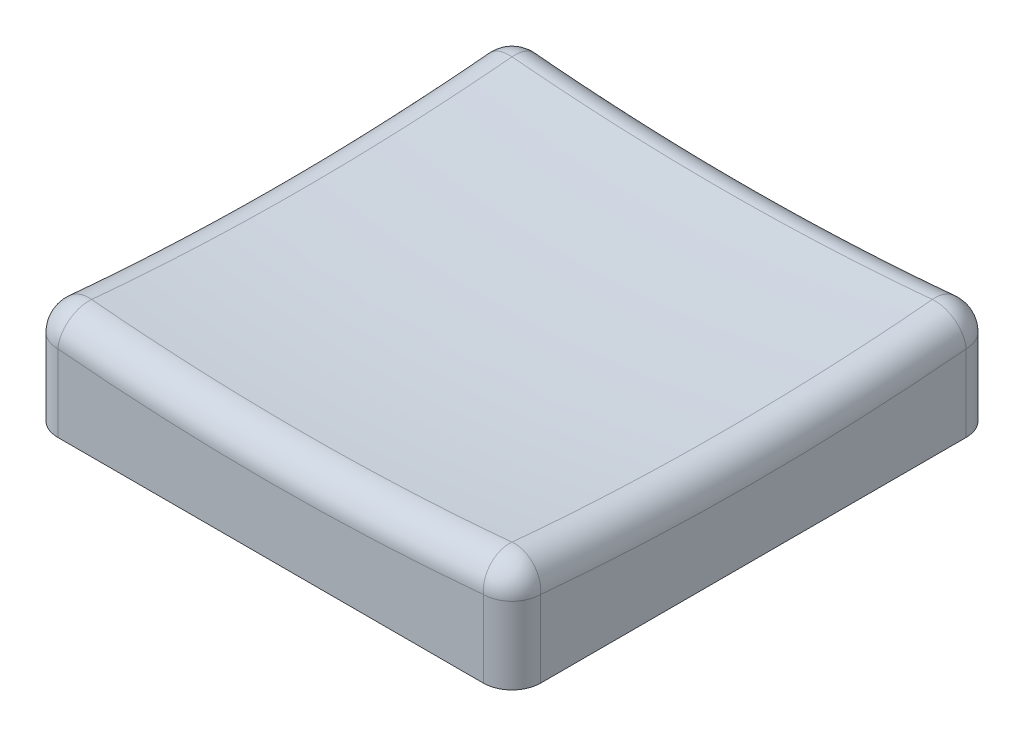
ISO-10303-21;
HEADER;
FILE_DESCRIPTION(('STEP AP214'),'2;1');
FILE_NAME('part.step','',(''),(''),'','','');
FILE_SCHEMA(('AUTOMOTIVE_DESIGN { 1 0 10303 214 1 1 1 1 }'));
ENDSEC;
DATA;
#1=APPLICATION_CONTEXT('core data for automotive mechanical design processes');
#2=APPLICATION_PROTOCOL_DEFINITION('international standard','automotive_design',2000,#1);
#3=PRODUCT_CONTEXT('',#1,'mechanical');
#4=PRODUCT('Part','Part','',(#3));
#5=PRODUCT_RELATED_PRODUCT_CATEGORY('part','',(#4));
#6=PRODUCT_DEFINITION_FORMATION('','',#4);
#7=PRODUCT_DEFINITION_CONTEXT('part definition',#1,'design');
#8=PRODUCT_DEFINITION('design','',#6,#7);
#9=PRODUCT_DEFINITION_SHAPE('','',#8);
#10=(LENGTH_UNIT() NAMED_UNIT(*) SI_UNIT(.MILLI.,.METRE.));
#11=(NAMED_UNIT(*) PLANE_ANGLE_UNIT() SI_UNIT($,.RADIAN.));
#12=(NAMED_UNIT(*) SI_UNIT($,.STERADIAN.) SOLID_ANGLE_UNIT());
#13=UNCERTAINTY_MEASURE_WITH_UNIT(LENGTH_MEASURE(1.E-05),#10,'distance_accuracy_value','');
#14=(GEOMETRIC_REPRESENTATION_CONTEXT(3) GLOBAL_UNCERTAINTY_ASSIGNED_CONTEXT((#13)) GLOBAL_UNIT_ASSIGNED_CONTEXT((#10,
#11,#12)) REPRESENTATION_CONTEXT('',''));
#15=CARTESIAN_POINT('',(0.,0.,0.));
#16=DIRECTION('',(0.,0.,1.));
#17=DIRECTION('',(1.,0.,0.));
#18=AXIS2_PLACEMENT_3D('',#15,#16,#17);
#19=CARTESIAN_POINT('',(8.425,4.,-8.425));
#20=DIRECTION('',(-1.,0.,0.));
#21=DIRECTION('',(0.,0.,1.));
#22=AXIS2_PLACEMENT_3D('',#19,#20,#21);
#23=PLANE('',#22);
#24=CARTESIAN_POINT('',(8.425,83.5,0.));
#25=DIRECTION('',(-1.,0.,0.));
#26=DIRECTION('',(0.,0.,1.));
#27=AXIS2_PLACEMENT_3D('',#24,#25,#26);
#28=CIRCLE('',#27,81.1610705634173);
#29=CARTESIAN_POINT('',(8.425,2.67928019375229,-7.425));
#30=VERTEX_POINT('',#29);
#31=CARTESIAN_POINT('',(8.425,2.67928019375229,7.425));
#32=VERTEX_POINT('',#31);
#33=EDGE_CURVE('E212',#30,#32,#28,.T.);
#34=ORIENTED_EDGE('',*,*,#33,.T.);
#35=DIRECTION('',(0.,-1.,0.));
#36=VECTOR('',#35,1.);
#37=CARTESIAN_POINT('',(8.425,4.,7.425));
#38=LINE('',#37,#36);
#39=CARTESIAN_POINT('',(8.425,0.,7.425));
#40=VERTEX_POINT('',#39);
#41=EDGE_CURVE('E215',#32,#40,#38,.T.);
#42=ORIENTED_EDGE('',*,*,#41,.T.);
#43=DIRECTION('',(0.,0.,-1.));
#44=VECTOR('',#43,1.);
#45=CARTESIAN_POINT('',(8.425,0.,-8.425));
#46=LINE('',#45,#44);
#47=CARTESIAN_POINT('',(8.425,0.,-7.425));
#48=VERTEX_POINT('',#47);
#49=EDGE_CURVE('E167',#40,#48,#46,.T.);
#50=ORIENTED_EDGE('',*,*,#49,.T.);
#51=DIRECTION('',(0.,-1.,0.));
#52=VECTOR('',#51,1.);
#53=CARTESIAN_POINT('',(8.425,4.,-7.425));
#54=LINE('',#53,#52);
#55=EDGE_CURVE('E209',#48,#30,#54,.F.);
#56=ORIENTED_EDGE('',*,*,#55,.T.);
#57=EDGE_LOOP('',(#34,#42,#50,#56));
#58=FACE_BOUND('',#57,.T.);
#59=ADVANCED_FACE('F39',(#58),#23,.F.);
#60=CARTESIAN_POINT('',(-8.425,4.,-8.425));
#61=DIRECTION('',(0.,0.,1.));
#62=DIRECTION('',(1.,0.,0.));
#63=AXIS2_PLACEMENT_3D('',#60,#61,#62);
#64=PLANE('',#63);
#65=CARTESIAN_POINT('',(0.,83.5,-8.425));
#66=DIRECTION('',(0.,0.,1.));
#67=DIRECTION('',(1.,0.,0.));
#68=AXIS2_PLACEMENT_3D('',#65,#66,#67);
#69=CIRCLE('',#68,81.1610705634173);
#70=CARTESIAN_POINT('',(-7.425,2.67928019375229,-8.425));
#71=VERTEX_POINT('',#70);
#72=CARTESIAN_POINT('',(7.425,2.67928019375229,-8.425));
#73=VERTEX_POINT('',#72);
#74=EDGE_CURVE('E256',#71,#73,#69,.T.);
#75=ORIENTED_EDGE('',*,*,#74,.T.);
#76=DIRECTION('',(0.,-1.,0.));
#77=VECTOR('',#76,1.);
#78=CARTESIAN_POINT('',(7.425,4.,-8.425));
#79=LINE('',#78,#77);
#80=CARTESIAN_POINT('',(7.425,0.,-8.425));
#81=VERTEX_POINT('',#80);
#82=EDGE_CURVE('E259',#73,#81,#79,.T.);
#83=ORIENTED_EDGE('',*,*,#82,.T.);
#84=DIRECTION('',(-1.,0.,0.));
#85=VECTOR('',#84,1.);
#86=CARTESIAN_POINT('',(-8.425,0.,-8.425));
#87=LINE('',#86,#85);
#88=CARTESIAN_POINT('',(-7.425,0.,-8.425));
#89=VERTEX_POINT('',#88);
#90=EDGE_CURVE('E173',#81,#89,#87,.T.);
#91=ORIENTED_EDGE('',*,*,#90,.T.);
#92=DIRECTION('',(0.,-1.,0.));
#93=VECTOR('',#92,1.);
#94=CARTESIAN_POINT('',(-7.425,4.,-8.425));
#95=LINE('',#94,#93);
#96=EDGE_CURVE('E253',#89,#71,#95,.F.);
#97=ORIENTED_EDGE('',*,*,#96,.T.);
#98=EDGE_LOOP('',(#75,#83,#91,#97));
#99=FACE_BOUND('',#98,.T.);
#100=ADVANCED_FACE('F347',(#99),#64,.F.);
#101=CARTESIAN_POINT('',(-8.425,4.,-8.425));
#102=DIRECTION('',(1.,0.,0.));
#103=DIRECTION('',(0.,0.,-1.));
#104=AXIS2_PLACEMENT_3D('',#101,#102,#103);
#105=PLANE('',#104);
#106=CARTESIAN_POINT('',(-8.425,83.5,0.));
#107=DIRECTION('',(1.,0.,0.));
#108=DIRECTION('',(0.,0.,-1.));
#109=AXIS2_PLACEMENT_3D('',#106,#107,#108);
#110=CIRCLE('',#109,81.1610705634173);
#111=CARTESIAN_POINT('',(-8.425,2.67928019375229,7.425));
#112=VERTEX_POINT('',#111);
#113=CARTESIAN_POINT('',(-8.425,2.67928019375229,-7.425));
#114=VERTEX_POINT('',#113);
#115=EDGE_CURVE('E56',#112,#114,#110,.T.);
#116=ORIENTED_EDGE('',*,*,#115,.T.);
#117=DIRECTION('',(0.,-1.,0.));
#118=VECTOR('',#117,1.);
#119=CARTESIAN_POINT('',(-8.425,4.,-7.425));
#120=LINE('',#119,#118);
#121=CARTESIAN_POINT('',(-8.425,0.,-7.425));
#122=VERTEX_POINT('',#121);
#123=EDGE_CURVE('E11',#114,#122,#120,.T.);
#124=ORIENTED_EDGE('',*,*,#123,.T.);
#125=DIRECTION('',(0.,0.,1.));
#126=VECTOR('',#125,1.);
#127=CARTESIAN_POINT('',(-8.425,0.,-8.425));
#128=LINE('',#127,#126);
#129=CARTESIAN_POINT('',(-8.425,0.,7.425));
#130=VERTEX_POINT('',#129);
#131=EDGE_CURVE('E202',#122,#130,#128,.T.);
#132=ORIENTED_EDGE('',*,*,#131,.T.);
#133=DIRECTION('',(0.,-1.,0.));
#134=VECTOR('',#133,1.);
#135=CARTESIAN_POINT('',(-8.425,4.,7.425));
#136=LINE('',#135,#134);
#137=EDGE_CURVE('E49',#130,#112,#136,.F.);
#138=ORIENTED_EDGE('',*,*,#137,.T.);
#139=EDGE_LOOP('',(#116,#124,#132,#138));
#140=FACE_BOUND('',#139,.T.);
#141=ADVANCED_FACE('F321',(#140),#105,.F.);
#142=CARTESIAN_POINT('',(-8.425,4.,8.425));
#143=DIRECTION('',(0.,0.,-1.));
#144=DIRECTION('',(-1.,0.,0.));
#145=AXIS2_PLACEMENT_3D('',#142,#143,#144);
#146=PLANE('',#145);
#147=DIRECTION('',(1.,0.,0.));
#148=VECTOR('',#147,1.);
#149=CARTESIAN_POINT('',(-8.425,0.,8.425));
#150=LINE('',#149,#148);
#151=CARTESIAN_POINT('',(-7.425,0.,8.425));
#152=VERTEX_POINT('',#151);
#153=CARTESIAN_POINT('',(7.425,0.,8.425));
#154=VERTEX_POINT('',#153);
#155=EDGE_CURVE('E205',#152,#154,#150,.T.);
#156=ORIENTED_EDGE('',*,*,#155,.T.);
#157=DIRECTION('',(0.,-1.,0.));
#158=VECTOR('',#157,1.);
#159=CARTESIAN_POINT('',(7.425,4.,8.425));
#160=LINE('',#159,#158);
#161=CARTESIAN_POINT('',(7.425,2.67928019375229,8.425));
#162=VERTEX_POINT('',#161);
#163=EDGE_CURVE('E237',#154,#162,#160,.F.);
#164=ORIENTED_EDGE('',*,*,#163,.T.);
#165=CARTESIAN_POINT('',(0.,83.5,8.425));
#166=DIRECTION('',(0.,0.,-1.));
#167=DIRECTION('',(-1.,0.,0.));
#168=AXIS2_PLACEMENT_3D('',#165,#166,#167);
#169=CIRCLE('',#168,81.1610705634173);
#170=CARTESIAN_POINT('',(-7.425,2.67928019375229,8.425));
#171=VERTEX_POINT('',#170);
#172=EDGE_CURVE('E231',#162,#171,#169,.T.);
#173=ORIENTED_EDGE('',*,*,#172,.T.);
#174=DIRECTION('',(0.,-1.,0.));
#175=VECTOR('',#174,1.);
#176=CARTESIAN_POINT('',(-7.425,4.,8.425));
#177=LINE('',#176,#175);
#178=EDGE_CURVE('E234',#171,#152,#177,.T.);
#179=ORIENTED_EDGE('',*,*,#178,.T.);
#180=EDGE_LOOP('',(#156,#164,#173,#179));
#181=FACE_BOUND('',#180,.T.);
#182=ADVANCED_FACE('F363',(#181),#146,.F.);
#183=CARTESIAN_POINT('',(0.,0.,0.));
#184=DIRECTION('',(0.,1.,0.));
#185=DIRECTION('',(0.,0.,1.));
#186=AXIS2_PLACEMENT_3D('',#183,#184,#185);
#187=PLANE('',#186);
#188=DIRECTION('',(1.,0.,0.));
#189=VECTOR('',#188,1.);
#190=CARTESIAN_POINT('',(-8.425,0.,6.925));
#191=LINE('',#190,#189);
#192=CARTESIAN_POINT('',(-6.925,0.,6.925));
#193=VERTEX_POINT('',#192);
#194=CARTESIAN_POINT('',(6.925,0.,6.925));
#195=VERTEX_POINT('',#194);
#196=EDGE_CURVE('E161',#193,#195,#191,.T.);
#197=ORIENTED_EDGE('',*,*,#196,.T.);
#198=DIRECTION('',(0.,0.,-1.));
#199=VECTOR('',#198,1.);
#200=CARTESIAN_POINT('',(6.925,0.,-8.425));
#201=LINE('',#200,#199);
#202=CARTESIAN_POINT('',(6.925,0.,-6.925));
#203=VERTEX_POINT('',#202);
#204=EDGE_CURVE('E187',#195,#203,#201,.T.);
#205=ORIENTED_EDGE('',*,*,#204,.T.);
#206=DIRECTION('',(-1.,0.,0.));
#207=VECTOR('',#206,1.);
#208=CARTESIAN_POINT('',(-8.425,0.,-6.925));
#209=LINE('',#208,#207);
#210=CARTESIAN_POINT('',(-6.925,0.,-6.925));
#211=VERTEX_POINT('',#210);
#212=EDGE_CURVE('E165',#203,#211,#209,.T.);
#213=ORIENTED_EDGE('',*,*,#212,.T.);
#214=DIRECTION('',(0.,0.,1.));
#215=VECTOR('',#214,1.);
#216=CARTESIAN_POINT('',(-6.925,0.,-8.425));
#217=LINE('',#216,#215);
#218=EDGE_CURVE('E193',#211,#193,#217,.T.);
#219=ORIENTED_EDGE('',*,*,#218,.T.);
#220=EDGE_LOOP('',(#197,#205,#213,#219));
#221=FACE_BOUND('',#220,.T.);
#222=ORIENTED_EDGE('',*,*,#49,.F.);
#223=CARTESIAN_POINT('',(7.425,0.,7.425));
#224=DIRECTION('',(0.,1.,0.));
#225=DIRECTION('',(0.,0.,1.));
#226=AXIS2_PLACEMENT_3D('',#223,#224,#225);
#227=CIRCLE('',#226,1.);
#228=EDGE_CURVE('E228',#40,#154,#227,.F.);
#229=ORIENTED_EDGE('',*,*,#228,.T.);
#230=ORIENTED_EDGE('',*,*,#155,.F.);
#231=CARTESIAN_POINT('',(-7.425,0.,7.425));
#232=DIRECTION('',(0.,1.,0.));
#233=DIRECTION('',(0.,0.,1.));
#234=AXIS2_PLACEMENT_3D('',#231,#232,#233);
#235=CIRCLE('',#234,1.);
#236=EDGE_CURVE('E219',#152,#130,#235,.F.);
#237=ORIENTED_EDGE('',*,*,#236,.T.);
#238=ORIENTED_EDGE('',*,*,#131,.F.);
#239=CARTESIAN_POINT('',(-7.425,0.,-7.425));
#240=DIRECTION('',(0.,1.,0.));
#241=DIRECTION('',(0.,0.,1.));
#242=AXIS2_PLACEMENT_3D('',#239,#240,#241);
#243=CIRCLE('',#242,1.);
#244=EDGE_CURVE('E222',#122,#89,#243,.F.);
#245=ORIENTED_EDGE('',*,*,#244,.T.);
#246=ORIENTED_EDGE('',*,*,#90,.F.);
#247=CARTESIAN_POINT('',(7.425,0.,-7.425));
#248=DIRECTION('',(0.,1.,0.));
#249=DIRECTION('',(0.,0.,1.));
#250=AXIS2_PLACEMENT_3D('',#247,#248,#249);
#251=CIRCLE('',#250,1.);
#252=EDGE_CURVE('E225',#81,#48,#251,.F.);
#253=ORIENTED_EDGE('',*,*,#252,.T.);
#254=EDGE_LOOP('',(#222,#229,#230,#237,#238,#245,#246,#253));
#255=FACE_BOUND('',#254,.T.);
#256=ADVANCED_FACE('F324',(#221,#255),#187,.F.);
#257=CARTESIAN_POINT('',(6.925,4.,-8.425));
#258=DIRECTION('',(-1.,0.,0.));
#259=DIRECTION('',(0.,0.,1.));
#260=AXIS2_PLACEMENT_3D('',#257,#258,#259);
#261=PLANE('',#260);
#262=ORIENTED_EDGE('',*,*,#204,.F.);
#263=DIRECTION('',(0.,-1.,0.));
#264=VECTOR('',#263,1.);
#265=CARTESIAN_POINT('',(6.925,4.,6.925));
#266=LINE('',#265,#264);
#267=CARTESIAN_POINT('',(6.925,2.5,6.925));
#268=VERTEX_POINT('',#267);
#269=EDGE_CURVE('E159',#268,#195,#266,.T.);
#270=ORIENTED_EDGE('',*,*,#269,.F.);
#271=DIRECTION('',(0.,0.,-1.));
#272=VECTOR('',#271,1.);
#273=CARTESIAN_POINT('',(6.925,2.5,-8.425));
#274=LINE('',#273,#272);
#275=CARTESIAN_POINT('',(6.925,2.5,-6.925));
#276=VERTEX_POINT('',#275);
#277=EDGE_CURVE('E144',#268,#276,#274,.T.);
#278=ORIENTED_EDGE('',*,*,#277,.T.);
#279=DIRECTION('',(0.,-1.,0.));
#280=VECTOR('',#279,1.);
#281=CARTESIAN_POINT('',(6.925,4.,-6.925));
#282=LINE('',#281,#280);
#283=EDGE_CURVE('E157',#276,#203,#282,.T.);
#284=ORIENTED_EDGE('',*,*,#283,.T.);
#285=EDGE_LOOP('',(#262,#270,#278,#284));
#286=FACE_BOUND('',#285,.T.);
#287=ADVANCED_FACE('F156',(#286),#261,.T.);
#288=CARTESIAN_POINT('',(-8.425,4.,-6.925));
#289=DIRECTION('',(0.,0.,1.));
#290=DIRECTION('',(1.,0.,0.));
#291=AXIS2_PLACEMENT_3D('',#288,#289,#290);
#292=PLANE('',#291);
#293=ORIENTED_EDGE('',*,*,#212,.F.);
#294=ORIENTED_EDGE('',*,*,#283,.F.);
#295=DIRECTION('',(-1.,0.,0.));
#296=VECTOR('',#295,1.);
#297=CARTESIAN_POINT('',(-8.425,2.5,-6.925));
#298=LINE('',#297,#296);
#299=CARTESIAN_POINT('',(-6.925,2.5,-6.925));
#300=VERTEX_POINT('',#299);
#301=EDGE_CURVE('E140',#276,#300,#298,.T.);
#302=ORIENTED_EDGE('',*,*,#301,.T.);
#303=DIRECTION('',(0.,-1.,0.));
#304=VECTOR('',#303,1.);
#305=CARTESIAN_POINT('',(-6.925,4.,-6.925));
#306=LINE('',#305,#304);
#307=EDGE_CURVE('E168',#300,#211,#306,.T.);
#308=ORIENTED_EDGE('',*,*,#307,.T.);
#309=EDGE_LOOP('',(#293,#294,#302,#308));
#310=FACE_BOUND('',#309,.T.);
#311=ADVANCED_FACE('F163',(#310),#292,.T.);
#312=CARTESIAN_POINT('',(-6.925,4.,-8.425));
#313=DIRECTION('',(1.,0.,0.));
#314=DIRECTION('',(0.,0.,-1.));
#315=AXIS2_PLACEMENT_3D('',#312,#313,#314);
#316=PLANE('',#315);
#317=ORIENTED_EDGE('',*,*,#218,.F.);
#318=ORIENTED_EDGE('',*,*,#307,.F.);
#319=DIRECTION('',(0.,0.,1.));
#320=VECTOR('',#319,1.);
#321=CARTESIAN_POINT('',(-6.925,2.5,-8.425));
#322=LINE('',#321,#320);
#323=CARTESIAN_POINT('',(-6.925,2.5,6.925));
#324=VERTEX_POINT('',#323);
#325=EDGE_CURVE('E145',#300,#324,#322,.T.);
#326=ORIENTED_EDGE('',*,*,#325,.T.);
#327=DIRECTION('',(0.,-1.,0.));
#328=VECTOR('',#327,1.);
#329=CARTESIAN_POINT('',(-6.925,4.,6.925));
#330=LINE('',#329,#328);
#331=EDGE_CURVE('E175',#324,#193,#330,.T.);
#332=ORIENTED_EDGE('',*,*,#331,.T.);
#333=EDGE_LOOP('',(#317,#318,#326,#332));
#334=FACE_BOUND('',#333,.T.);
#335=ADVANCED_FACE('F490',(#334),#316,.T.);
#336=CARTESIAN_POINT('',(-8.425,4.,6.925));
#337=DIRECTION('',(0.,0.,-1.));
#338=DIRECTION('',(-1.,0.,0.));
#339=AXIS2_PLACEMENT_3D('',#336,#337,#338);
#340=PLANE('',#339);
#341=ORIENTED_EDGE('',*,*,#196,.F.);
#342=ORIENTED_EDGE('',*,*,#331,.F.);
#343=DIRECTION('',(1.,0.,0.));
#344=VECTOR('',#343,1.);
#345=CARTESIAN_POINT('',(-8.425,2.5,6.925));
#346=LINE('',#345,#344);
#347=EDGE_CURVE('E179',#324,#268,#346,.T.);
#348=ORIENTED_EDGE('',*,*,#347,.T.);
#349=ORIENTED_EDGE('',*,*,#269,.T.);
#350=EDGE_LOOP('',(#341,#342,#348,#349));
#351=FACE_BOUND('',#350,.T.);
#352=ADVANCED_FACE('F482',(#351),#340,.T.);
#353=CARTESIAN_POINT('',(0.,2.5,0.));
#354=DIRECTION('',(0.,1.,0.));
#355=DIRECTION('',(0.,0.,1.));
#356=AXIS2_PLACEMENT_3D('',#353,#354,#355);
#357=PLANE('',#356);
#358=ORIENTED_EDGE('',*,*,#277,.F.);
#359=ORIENTED_EDGE('',*,*,#347,.F.);
#360=ORIENTED_EDGE('',*,*,#325,.F.);
#361=ORIENTED_EDGE('',*,*,#301,.F.);
#362=EDGE_LOOP('',(#358,#359,#360,#361));
#363=FACE_BOUND('',#362,.T.);
#364=ADVANCED_FACE('F142',(#363),#357,.F.);
#365=CARTESIAN_POINT('',(0.,83.5,0.));
#366=DIRECTION('',(0.,-1.,0.));
#367=DIRECTION('',(-1.,0.,0.));
#368=AXIS2_PLACEMENT_3D('',#365,#366,#367);
#369=SPHERICAL_SURFACE('',#368,80.5);
#370=CARTESIAN_POINT('',(0.,83.5,7.33389570552147));
#371=DIRECTION('',(0.,0.,-1.));
#372=DIRECTION('',(-1.,0.,0.));
#373=AXIS2_PLACEMENT_3D('',#370,#371,#372);
#374=CIRCLE('',#373,80.1652292068109);
#375=CARTESIAN_POINT('',(-7.33389570552147,3.67094546744858,7.33389570552147));
#376=VERTEX_POINT('',#375);
#377=CARTESIAN_POINT('',(7.33389570552147,3.67094546744858,7.33389570552147));
#378=VERTEX_POINT('',#377);
#379=EDGE_CURVE('E243',#376,#378,#374,.F.);
#380=ORIENTED_EDGE('',*,*,#379,.T.);
#381=CARTESIAN_POINT('',(7.33389570552147,83.5,0.));
#382=DIRECTION('',(-1.,0.,0.));
#383=DIRECTION('',(0.,0.,1.));
#384=AXIS2_PLACEMENT_3D('',#381,#382,#383);
#385=CIRCLE('',#384,80.1652292068109);
#386=CARTESIAN_POINT('',(7.33389570552147,3.67094546744858,-7.33389570552147));
#387=VERTEX_POINT('',#386);
#388=EDGE_CURVE('E249',#378,#387,#385,.F.);
#389=ORIENTED_EDGE('',*,*,#388,.T.);
#390=CARTESIAN_POINT('',(0.,83.5,-7.33389570552147));
#391=DIRECTION('',(0.,0.,1.));
#392=DIRECTION('',(1.,0.,0.));
#393=AXIS2_PLACEMENT_3D('',#390,#391,#392);
#394=CIRCLE('',#393,80.1652292068109);
#395=CARTESIAN_POINT('',(-7.33389570552148,3.67094546744858,-7.33389570552147));
#396=VERTEX_POINT('',#395);
#397=EDGE_CURVE('E246',#387,#396,#394,.F.);
#398=ORIENTED_EDGE('',*,*,#397,.T.);
#399=CARTESIAN_POINT('',(-7.33389570552147,83.5,0.));
#400=DIRECTION('',(1.,0.,0.));
#401=DIRECTION('',(0.,0.,-1.));
#402=AXIS2_PLACEMENT_3D('',#399,#400,#401);
#403=CIRCLE('',#402,80.1652292068109);
#404=EDGE_CURVE('E240',#396,#376,#403,.F.);
#405=ORIENTED_EDGE('',*,*,#404,.T.);
#406=EDGE_LOOP('',(#380,#389,#398,#405));
#407=FACE_BOUND('',#406,.T.);
#408=ADVANCED_FACE('F339',(#407),#369,.F.);
#409=CARTESIAN_POINT('',(-7.425,4.,-7.425));
#410=DIRECTION('',(0.,-1.,0.));
#411=DIRECTION('',(0.,0.,-1.));
#412=AXIS2_PLACEMENT_3D('',#409,#410,#411);
#413=CYLINDRICAL_SURFACE('',#412,1.);
#414=CARTESIAN_POINT('',(-7.425,2.67928019375229,-7.425));
#415=DIRECTION('',(0.,1.,0.));
#416=DIRECTION('',(0.,0.,1.));
#417=AXIS2_PLACEMENT_3D('',#414,#415,#416);
#418=CIRCLE('',#417,1.);
#419=EDGE_CURVE('E43',#71,#114,#418,.T.);
#420=ORIENTED_EDGE('',*,*,#419,.F.);
#421=ORIENTED_EDGE('',*,*,#96,.F.);
#422=ORIENTED_EDGE('',*,*,#244,.F.);
#423=ORIENTED_EDGE('',*,*,#123,.F.);
#424=EDGE_LOOP('',(#420,#421,#422,#423));
#425=FACE_BOUND('',#424,.T.);
#426=ADVANCED_FACE('F41',(#425),#413,.T.);
#427=CARTESIAN_POINT('',(-7.425,2.67928019375229,-7.425));
#428=DIRECTION('',(0.,0.,1.));
#429=DIRECTION('',(1.,0.,0.));
#430=AXIS2_PLACEMENT_3D('',#427,#428,#429);
#431=SPHERICAL_SURFACE('',#430,1.);
#432=CARTESIAN_POINT('',(-7.425,2.67928019375229,-7.425));
#433=DIRECTION('',(-0.995806477726244,0.0914847469169134,0.));
#434=DIRECTION('',(-0.0914847469169134,-0.995806477726244,0.));
#435=AXIS2_PLACEMENT_3D('',#432,#433,#434);
#436=CIRCLE('',#435,1.);
#437=EDGE_CURVE('E301',#71,#396,#436,.F.);
#438=ORIENTED_EDGE('',*,*,#437,.F.);
#439=ORIENTED_EDGE('',*,*,#419,.T.);
#440=CARTESIAN_POINT('',(-7.425,2.67928019375229,-7.425));
#441=DIRECTION('',(0.,0.0914847469169143,-0.995806477726244));
#442=DIRECTION('',(0.,0.995806477726244,0.0914847469169143));
#443=AXIS2_PLACEMENT_3D('',#440,#441,#442);
#444=CIRCLE('',#443,1.);
#445=EDGE_CURVE('E304',#396,#114,#444,.F.);
#446=ORIENTED_EDGE('',*,*,#445,.F.);
#447=EDGE_LOOP('',(#438,#439,#446));
#448=FACE_BOUND('',#447,.T.);
#449=ADVANCED_FACE('F315',(#448),#431,.T.);
#450=CARTESIAN_POINT('',(-7.425,4.,7.425));
#451=DIRECTION('',(0.,-1.,0.));
#452=DIRECTION('',(0.,0.,-1.));
#453=AXIS2_PLACEMENT_3D('',#450,#451,#452);
#454=CYLINDRICAL_SURFACE('',#453,1.);
#455=ORIENTED_EDGE('',*,*,#236,.F.);
#456=ORIENTED_EDGE('',*,*,#178,.F.);
#457=CARTESIAN_POINT('',(-7.425,2.67928019375229,7.425));
#458=DIRECTION('',(0.,1.,0.));
#459=DIRECTION('',(0.,0.,1.));
#460=AXIS2_PLACEMENT_3D('',#457,#458,#459);
#461=CIRCLE('',#460,1.);
#462=EDGE_CURVE('E297',#112,#171,#461,.T.);
#463=ORIENTED_EDGE('',*,*,#462,.F.);
#464=ORIENTED_EDGE('',*,*,#137,.F.);
#465=EDGE_LOOP('',(#455,#456,#463,#464));
#466=FACE_BOUND('',#465,.T.);
#467=ADVANCED_FACE('F330',(#466),#454,.T.);
#468=CARTESIAN_POINT('',(-7.425,83.5,0.));
#469=DIRECTION('',(1.,0.,0.));
#470=DIRECTION('',(0.,0.,-1.));
#471=AXIS2_PLACEMENT_3D('',#468,#469,#470);
#472=TOROIDAL_SURFACE('',#471,81.1610705634173,1.);
#473=ORIENTED_EDGE('',*,*,#445,.T.);
#474=ORIENTED_EDGE('',*,*,#115,.F.);
#475=CARTESIAN_POINT('',(-7.425,2.67928019375229,7.425));
#476=DIRECTION('',(0.,0.0914847469169134,0.995806477726244));
#477=DIRECTION('',(0.,-0.995806477726244,0.0914847469169134));
#478=AXIS2_PLACEMENT_3D('',#475,#476,#477);
#479=CIRCLE('',#478,1.);
#480=EDGE_CURVE('E293',#376,#112,#479,.T.);
#481=ORIENTED_EDGE('',*,*,#480,.F.);
#482=ORIENTED_EDGE('',*,*,#404,.F.);
#483=EDGE_LOOP('',(#473,#474,#481,#482));
#484=FACE_BOUND('',#483,.T.);
#485=ADVANCED_FACE('F337',(#484),#472,.T.);
#486=CARTESIAN_POINT('',(0.,83.5,-7.425));
#487=DIRECTION('',(0.,0.,1.));
#488=DIRECTION('',(1.,0.,0.));
#489=AXIS2_PLACEMENT_3D('',#486,#487,#488);
#490=TOROIDAL_SURFACE('',#489,81.1610705634173,1.);
#491=ORIENTED_EDGE('',*,*,#437,.T.);
#492=ORIENTED_EDGE('',*,*,#397,.F.);
#493=CARTESIAN_POINT('',(7.425,2.67928019375229,-7.425));
#494=DIRECTION('',(0.995806477726244,0.0914847469169117,0.));
#495=DIRECTION('',(-0.0914847469169117,0.995806477726244,0.));
#496=AXIS2_PLACEMENT_3D('',#493,#494,#495);
#497=CIRCLE('',#496,1.);
#498=EDGE_CURVE('E289',#73,#387,#497,.T.);
#499=ORIENTED_EDGE('',*,*,#498,.F.);
#500=ORIENTED_EDGE('',*,*,#74,.F.);
#501=EDGE_LOOP('',(#491,#492,#499,#500));
#502=FACE_BOUND('',#501,.T.);
#503=ADVANCED_FACE('F344',(#502),#490,.T.);
#504=CARTESIAN_POINT('',(7.425,4.,-7.425));
#505=DIRECTION('',(0.,-1.,0.));
#506=DIRECTION('',(0.,0.,-1.));
#507=AXIS2_PLACEMENT_3D('',#504,#505,#506);
#508=CYLINDRICAL_SURFACE('',#507,1.);
#509=ORIENTED_EDGE('',*,*,#252,.F.);
#510=ORIENTED_EDGE('',*,*,#82,.F.);
#511=CARTESIAN_POINT('',(7.425,2.67928019375229,-7.425));
#512=DIRECTION('',(0.,1.,0.));
#513=DIRECTION('',(0.,0.,1.));
#514=AXIS2_PLACEMENT_3D('',#511,#512,#513);
#515=CIRCLE('',#514,1.);
#516=EDGE_CURVE('E285',#30,#73,#515,.T.);
#517=ORIENTED_EDGE('',*,*,#516,.F.);
#518=ORIENTED_EDGE('',*,*,#55,.F.);
#519=EDGE_LOOP('',(#509,#510,#517,#518));
#520=FACE_BOUND('',#519,.T.);
#521=ADVANCED_FACE('F351',(#520),#508,.T.);
#522=CARTESIAN_POINT('',(-7.425,2.67928019375229,7.425));
#523=DIRECTION('',(0.,0.,1.));
#524=DIRECTION('',(1.,0.,0.));
#525=AXIS2_PLACEMENT_3D('',#522,#523,#524);
#526=SPHERICAL_SURFACE('',#525,1.);
#527=ORIENTED_EDGE('',*,*,#480,.T.);
#528=ORIENTED_EDGE('',*,*,#462,.T.);
#529=CARTESIAN_POINT('',(-7.425,2.67928019375229,7.425));
#530=DIRECTION('',(-0.995806477726244,0.0914847469169126,0.));
#531=DIRECTION('',(-0.0914847469169126,-0.995806477726244,0.));
#532=AXIS2_PLACEMENT_3D('',#529,#530,#531);
#533=CIRCLE('',#532,1.);
#534=EDGE_CURVE('E281',#376,#171,#533,.F.);
#535=ORIENTED_EDGE('',*,*,#534,.F.);
#536=EDGE_LOOP('',(#527,#528,#535));
#537=FACE_BOUND('',#536,.T.);
#538=ADVANCED_FACE('F335',(#537),#526,.T.);
#539=CARTESIAN_POINT('',(7.425,2.67928019375231,-7.425));
#540=DIRECTION('',(0.,0.,1.));
#541=DIRECTION('',(1.,0.,0.));
#542=AXIS2_PLACEMENT_3D('',#539,#540,#541);
#543=SPHERICAL_SURFACE('',#542,1.);
#544=ORIENTED_EDGE('',*,*,#516,.T.);
#545=ORIENTED_EDGE('',*,*,#498,.T.);
#546=CARTESIAN_POINT('',(7.425,2.67928019375229,-7.425));
#547=DIRECTION('',(0.,0.0914847469169134,-0.995806477726244));
#548=DIRECTION('',(0.,0.995806477726244,0.0914847469169134));
#549=AXIS2_PLACEMENT_3D('',#546,#547,#548);
#550=CIRCLE('',#549,1.);
#551=EDGE_CURVE('E278',#30,#387,#550,.F.);
#552=ORIENTED_EDGE('',*,*,#551,.F.);
#553=EDGE_LOOP('',(#544,#545,#552));
#554=FACE_BOUND('',#553,.T.);
#555=ADVANCED_FACE('F373',(#554),#543,.T.);
#556=CARTESIAN_POINT('',(0.,83.5,7.425));
#557=DIRECTION('',(0.,0.,-1.));
#558=DIRECTION('',(-1.,0.,0.));
#559=AXIS2_PLACEMENT_3D('',#556,#557,#558);
#560=TOROIDAL_SURFACE('',#559,81.1610705634173,1.);
#561=ORIENTED_EDGE('',*,*,#534,.T.);
#562=ORIENTED_EDGE('',*,*,#172,.F.);
#563=CARTESIAN_POINT('',(7.425,2.67928019375229,7.425));
#564=DIRECTION('',(0.995806477726244,0.0914847469169133,0.));
#565=DIRECTION('',(-0.0914847469169133,0.995806477726244,0.));
#566=AXIS2_PLACEMENT_3D('',#563,#564,#565);
#567=CIRCLE('',#566,1.);
#568=EDGE_CURVE('E274',#378,#162,#567,.T.);
#569=ORIENTED_EDGE('',*,*,#568,.F.);
#570=ORIENTED_EDGE('',*,*,#379,.F.);
#571=EDGE_LOOP('',(#561,#562,#569,#570));
#572=FACE_BOUND('',#571,.T.);
#573=ADVANCED_FACE('F367',(#572),#560,.T.);
#574=CARTESIAN_POINT('',(7.425,83.5,0.));
#575=DIRECTION('',(-1.,0.,0.));
#576=DIRECTION('',(0.,0.,1.));
#577=AXIS2_PLACEMENT_3D('',#574,#575,#576);
#578=TOROIDAL_SURFACE('',#577,81.1610705634173,1.);
#579=ORIENTED_EDGE('',*,*,#551,.T.);
#580=ORIENTED_EDGE('',*,*,#388,.F.);
#581=CARTESIAN_POINT('',(7.425,2.67928019375229,7.425));
#582=DIRECTION('',(0.,0.0914847469169118,0.995806477726244));
#583=DIRECTION('',(0.,-0.995806477726244,0.0914847469169118));
#584=AXIS2_PLACEMENT_3D('',#581,#582,#583);
#585=CIRCLE('',#584,1.);
#586=EDGE_CURVE('E270',#32,#378,#585,.T.);
#587=ORIENTED_EDGE('',*,*,#586,.F.);
#588=ORIENTED_EDGE('',*,*,#33,.F.);
#589=EDGE_LOOP('',(#579,#580,#587,#588));
#590=FACE_BOUND('',#589,.T.);
#591=ADVANCED_FACE('F371',(#590),#578,.T.);
#592=CARTESIAN_POINT('',(7.425,2.67928019375229,7.425));
#593=DIRECTION('',(0.,0.,1.));
#594=DIRECTION('',(1.,0.,0.));
#595=AXIS2_PLACEMENT_3D('',#592,#593,#594);
#596=SPHERICAL_SURFACE('',#595,1.);
#597=ORIENTED_EDGE('',*,*,#586,.T.);
#598=ORIENTED_EDGE('',*,*,#568,.T.);
#599=CARTESIAN_POINT('',(7.425,2.67928019375229,7.425));
#600=DIRECTION('',(0.,1.,0.));
#601=DIRECTION('',(0.,0.,1.));
#602=AXIS2_PLACEMENT_3D('',#599,#600,#601);
#603=CIRCLE('',#602,1.);
#604=EDGE_CURVE('E266',#32,#162,#603,.F.);
#605=ORIENTED_EDGE('',*,*,#604,.F.);
#606=EDGE_LOOP('',(#597,#598,#605));
#607=FACE_BOUND('',#606,.T.);
#608=ADVANCED_FACE('F369',(#607),#596,.T.);
#609=CARTESIAN_POINT('',(7.425,4.,7.425));
#610=DIRECTION('',(0.,-1.,0.));
#611=DIRECTION('',(0.,0.,-1.));
#612=AXIS2_PLACEMENT_3D('',#609,#610,#611);
#613=CYLINDRICAL_SURFACE('',#612,1.);
#614=ORIENTED_EDGE('',*,*,#604,.T.);
#615=ORIENTED_EDGE('',*,*,#163,.F.);
#616=ORIENTED_EDGE('',*,*,#228,.F.);
#617=ORIENTED_EDGE('',*,*,#41,.F.);
#618=EDGE_LOOP('',(#614,#615,#616,#617));
#619=FACE_BOUND('',#618,.T.);
#620=ADVANCED_FACE('F359',(#619),#613,.T.);
#621=CLOSED_SHELL('',(#59,#100,#141,#182,#256,#287,#311,#335,#352,#364,#408,#426,#449,#467,#485,
#503,#521,#538,#555,#573,#591,#608,#620));
#622=MANIFOLD_SOLID_BREP('B2',#621);
#623=ADVANCED_BREP_SHAPE_REPRESENTATION('',(#18,#622),#14);
#624=SHAPE_DEFINITION_REPRESENTATION(#9,#623);
ENDSEC;
END-ISO-10303-21;
